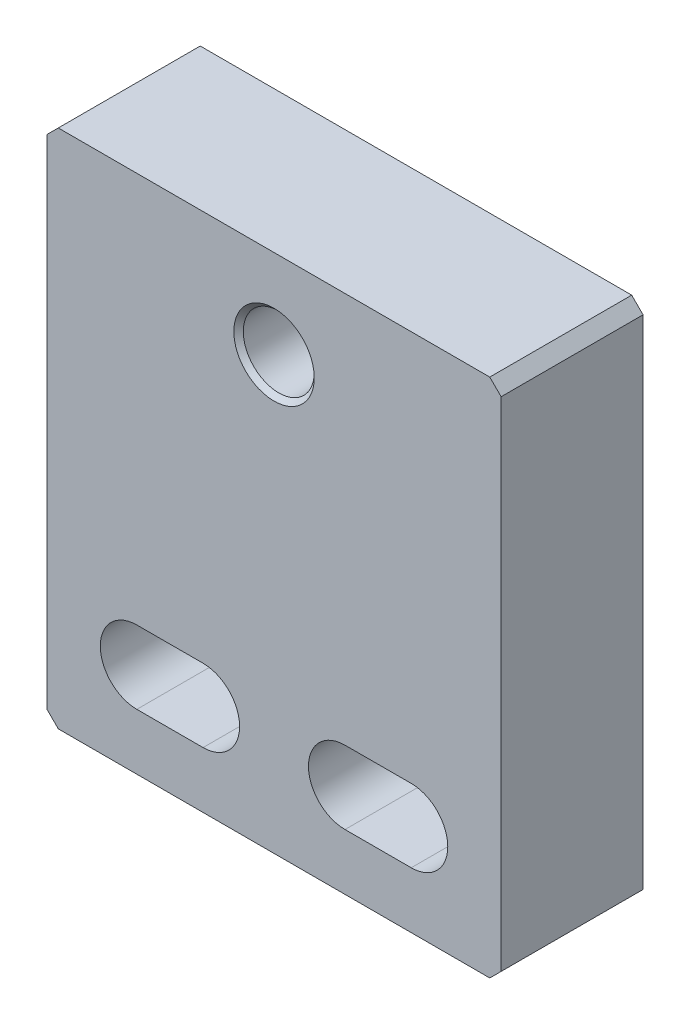
ISO-10303-21;
HEADER;
FILE_DESCRIPTION(('STEP AP214'),'2;1');
FILE_NAME('part.step','',(''),(''),'','','');
FILE_SCHEMA(('AUTOMOTIVE_DESIGN { 1 0 10303 214 1 1 1 1 }'));
ENDSEC;
DATA;
#1=APPLICATION_CONTEXT('core data for automotive mechanical design processes');
#2=APPLICATION_PROTOCOL_DEFINITION('international standard','automotive_design',2000,#1);
#3=PRODUCT_CONTEXT('',#1,'mechanical');
#4=PRODUCT('Part','Part','',(#3));
#5=PRODUCT_RELATED_PRODUCT_CATEGORY('part','',(#4));
#6=PRODUCT_DEFINITION_FORMATION('','',#4);
#7=PRODUCT_DEFINITION_CONTEXT('part definition',#1,'design');
#8=PRODUCT_DEFINITION('design','',#6,#7);
#9=PRODUCT_DEFINITION_SHAPE('','',#8);
#10=(LENGTH_UNIT() NAMED_UNIT(*) SI_UNIT(.MILLI.,.METRE.));
#11=(NAMED_UNIT(*) PLANE_ANGLE_UNIT() SI_UNIT($,.RADIAN.));
#12=(NAMED_UNIT(*) SI_UNIT($,.STERADIAN.) SOLID_ANGLE_UNIT());
#13=UNCERTAINTY_MEASURE_WITH_UNIT(LENGTH_MEASURE(1.E-05),#10,'distance_accuracy_value','');
#14=(GEOMETRIC_REPRESENTATION_CONTEXT(3) GLOBAL_UNCERTAINTY_ASSIGNED_CONTEXT((#13)) GLOBAL_UNIT_ASSIGNED_CONTEXT((#10,
#11,#12)) REPRESENTATION_CONTEXT('',''));
#15=CARTESIAN_POINT('',(0.,0.,0.));
#16=DIRECTION('',(0.,0.,1.));
#17=DIRECTION('',(1.,0.,0.));
#18=AXIS2_PLACEMENT_3D('',#15,#16,#17);
#19=CARTESIAN_POINT('',(-30.4799999999999,55.88,-19.05));
#20=DIRECTION('',(-0.707106781186456,0.707106781186639,0.));
#21=DIRECTION('',(-0.707106781186639,-0.707106781186456,0.));
#22=AXIS2_PLACEMENT_3D('',#19,#20,#21);
#23=PLANE('',#22);
#24=DIRECTION('',(-0.707106781186639,-0.707106781186456,0.));
#25=VECTOR('',#24,1.);
#26=CARTESIAN_POINT('',(-30.4799999999999,55.88,0.));
#27=LINE('',#26,#25);
#28=CARTESIAN_POINT('',(-28.9559999999999,57.4039999999996,0.));
#29=VERTEX_POINT('',#28);
#30=CARTESIAN_POINT('',(-30.4799999999999,55.88,0.));
#31=VERTEX_POINT('',#30);
#32=EDGE_CURVE('E217',#29,#31,#27,.T.);
#33=ORIENTED_EDGE('',*,*,#32,.F.);
#34=DIRECTION('',(0.,0.,1.));
#35=VECTOR('',#34,1.);
#36=CARTESIAN_POINT('',(-28.9559999999999,57.4039999999996,-19.05));
#37=LINE('',#36,#35);
#38=CARTESIAN_POINT('',(-28.9559999999999,57.4039999999996,-19.05));
#39=VERTEX_POINT('',#38);
#40=EDGE_CURVE('E11',#39,#29,#37,.T.);
#41=ORIENTED_EDGE('',*,*,#40,.F.);
#42=DIRECTION('',(-0.707106781186639,-0.707106781186456,0.));
#43=VECTOR('',#42,1.);
#44=CARTESIAN_POINT('',(-30.4799999999999,55.88,-19.05));
#45=LINE('',#44,#43);
#46=CARTESIAN_POINT('',(-30.4799999999999,55.88,-19.05));
#47=VERTEX_POINT('',#46);
#48=EDGE_CURVE('E224',#39,#47,#45,.T.);
#49=ORIENTED_EDGE('',*,*,#48,.T.);
#50=DIRECTION('',(0.,0.,1.));
#51=VECTOR('',#50,1.);
#52=CARTESIAN_POINT('',(-30.4799999999999,55.88,-19.05));
#53=LINE('',#52,#51);
#54=EDGE_CURVE('E42',#47,#31,#53,.T.);
#55=ORIENTED_EDGE('',*,*,#54,.T.);
#56=EDGE_LOOP('',(#33,#41,#49,#55));
#57=FACE_BOUND('',#56,.T.);
#58=ADVANCED_FACE('F39',(#57),#23,.T.);
#59=CARTESIAN_POINT('',(-28.9559999999999,57.4039999999996,-19.05));
#60=DIRECTION('',(0.,1.,0.));
#61=DIRECTION('',(-1.,0.,0.));
#62=AXIS2_PLACEMENT_3D('',#59,#60,#61);
#63=PLANE('',#62);
#64=DIRECTION('',(-1.,0.,0.));
#65=VECTOR('',#64,1.);
#66=CARTESIAN_POINT('',(-28.9559999999999,57.4039999999996,0.));
#67=LINE('',#66,#65);
#68=CARTESIAN_POINT('',(28.9559999999999,57.4039999999996,0.));
#69=VERTEX_POINT('',#68);
#70=EDGE_CURVE('E228',#69,#29,#67,.T.);
#71=ORIENTED_EDGE('',*,*,#70,.F.);
#72=DIRECTION('',(0.,0.,1.));
#73=VECTOR('',#72,1.);
#74=CARTESIAN_POINT('',(28.9559999999999,57.4039999999996,-19.05));
#75=LINE('',#74,#73);
#76=CARTESIAN_POINT('',(28.9559999999999,57.4039999999996,-19.05));
#77=VERTEX_POINT('',#76);
#78=EDGE_CURVE('E47',#77,#69,#75,.T.);
#79=ORIENTED_EDGE('',*,*,#78,.F.);
#80=DIRECTION('',(-1.,0.,0.));
#81=VECTOR('',#80,1.);
#82=CARTESIAN_POINT('',(-28.9559999999999,57.4039999999996,-19.05));
#83=LINE('',#82,#81);
#84=EDGE_CURVE('E246',#77,#39,#83,.T.);
#85=ORIENTED_EDGE('',*,*,#84,.T.);
#86=ORIENTED_EDGE('',*,*,#40,.T.);
#87=EDGE_LOOP('',(#71,#79,#85,#86));
#88=FACE_BOUND('',#87,.T.);
#89=ADVANCED_FACE('F293',(#88),#63,.T.);
#90=CARTESIAN_POINT('',(28.9559999999999,57.4039999999996,-19.05));
#91=DIRECTION('',(0.707106781186549,0.707106781186546,0.));
#92=DIRECTION('',(-0.707106781186546,0.707106781186549,0.));
#93=AXIS2_PLACEMENT_3D('',#90,#91,#92);
#94=PLANE('',#93);
#95=DIRECTION('',(-0.707106781186546,0.707106781186549,0.));
#96=VECTOR('',#95,1.);
#97=CARTESIAN_POINT('',(28.9559999999999,57.4039999999996,0.));
#98=LINE('',#97,#96);
#99=CARTESIAN_POINT('',(30.4799999999999,55.8799999999996,0.));
#100=VERTEX_POINT('',#99);
#101=EDGE_CURVE('E266',#100,#69,#98,.T.);
#102=ORIENTED_EDGE('',*,*,#101,.F.);
#103=DIRECTION('',(0.,0.,1.));
#104=VECTOR('',#103,1.);
#105=CARTESIAN_POINT('',(30.4799999999999,55.8799999999996,-19.05));
#106=LINE('',#105,#104);
#107=CARTESIAN_POINT('',(30.4799999999999,55.8799999999996,-19.05));
#108=VERTEX_POINT('',#107);
#109=EDGE_CURVE('E272',#108,#100,#106,.T.);
#110=ORIENTED_EDGE('',*,*,#109,.F.);
#111=DIRECTION('',(-0.707106781186546,0.707106781186549,0.));
#112=VECTOR('',#111,1.);
#113=CARTESIAN_POINT('',(28.9559999999999,57.4039999999996,-19.05));
#114=LINE('',#113,#112);
#115=EDGE_CURVE('E243',#108,#77,#114,.T.);
#116=ORIENTED_EDGE('',*,*,#115,.T.);
#117=ORIENTED_EDGE('',*,*,#78,.T.);
#118=EDGE_LOOP('',(#102,#110,#116,#117));
#119=FACE_BOUND('',#118,.T.);
#120=ADVANCED_FACE('F313',(#119),#94,.T.);
#121=CARTESIAN_POINT('',(30.4799999999999,55.8799999999996,-19.05));
#122=DIRECTION('',(1.,0.,0.));
#123=DIRECTION('',(0.,1.,0.));
#124=AXIS2_PLACEMENT_3D('',#121,#122,#123);
#125=PLANE('',#124);
#126=DIRECTION('',(0.,1.,0.));
#127=VECTOR('',#126,1.);
#128=CARTESIAN_POINT('',(30.4799999999999,55.8799999999996,0.));
#129=LINE('',#128,#127);
#130=CARTESIAN_POINT('',(30.48,-10.922,0.));
#131=VERTEX_POINT('',#130);
#132=EDGE_CURVE('E263',#131,#100,#129,.T.);
#133=ORIENTED_EDGE('',*,*,#132,.F.);
#134=DIRECTION('',(0.,0.,1.));
#135=VECTOR('',#134,1.);
#136=CARTESIAN_POINT('',(30.48,-10.922,-19.05));
#137=LINE('',#136,#135);
#138=CARTESIAN_POINT('',(30.48,-10.922,-19.05));
#139=VERTEX_POINT('',#138);
#140=EDGE_CURVE('E274',#139,#131,#137,.T.);
#141=ORIENTED_EDGE('',*,*,#140,.F.);
#142=DIRECTION('',(0.,1.,0.));
#143=VECTOR('',#142,1.);
#144=CARTESIAN_POINT('',(30.4799999999999,55.8799999999996,-19.05));
#145=LINE('',#144,#143);
#146=EDGE_CURVE('E240',#139,#108,#145,.T.);
#147=ORIENTED_EDGE('',*,*,#146,.T.);
#148=ORIENTED_EDGE('',*,*,#109,.T.);
#149=EDGE_LOOP('',(#133,#141,#147,#148));
#150=FACE_BOUND('',#149,.T.);
#151=ADVANCED_FACE('F311',(#150),#125,.T.);
#152=CARTESIAN_POINT('',(28.956,-12.446,-19.05));
#153=DIRECTION('',(0.707106781186548,-0.707106781186547,0.));
#154=DIRECTION('',(0.707106781186547,0.707106781186548,0.));
#155=AXIS2_PLACEMENT_3D('',#152,#153,#154);
#156=PLANE('',#155);
#157=DIRECTION('',(0.707106781186547,0.707106781186548,0.));
#158=VECTOR('',#157,1.);
#159=CARTESIAN_POINT('',(28.956,-12.446,0.));
#160=LINE('',#159,#158);
#161=CARTESIAN_POINT('',(28.956,-12.446,0.));
#162=VERTEX_POINT('',#161);
#163=EDGE_CURVE('E260',#162,#131,#160,.T.);
#164=ORIENTED_EDGE('',*,*,#163,.F.);
#165=DIRECTION('',(0.,0.,1.));
#166=VECTOR('',#165,1.);
#167=CARTESIAN_POINT('',(28.956,-12.446,-19.05));
#168=LINE('',#167,#166);
#169=CARTESIAN_POINT('',(28.956,-12.446,-19.05));
#170=VERTEX_POINT('',#169);
#171=EDGE_CURVE('E276',#170,#162,#168,.T.);
#172=ORIENTED_EDGE('',*,*,#171,.F.);
#173=DIRECTION('',(0.707106781186547,0.707106781186548,0.));
#174=VECTOR('',#173,1.);
#175=CARTESIAN_POINT('',(28.956,-12.446,-19.05));
#176=LINE('',#175,#174);
#177=EDGE_CURVE('E237',#170,#139,#176,.T.);
#178=ORIENTED_EDGE('',*,*,#177,.T.);
#179=ORIENTED_EDGE('',*,*,#140,.T.);
#180=EDGE_LOOP('',(#164,#172,#178,#179));
#181=FACE_BOUND('',#180,.T.);
#182=ADVANCED_FACE('F307',(#181),#156,.T.);
#183=CARTESIAN_POINT('',(-28.956,-12.446,-19.05));
#184=DIRECTION('',(0.,-1.,0.));
#185=DIRECTION('',(0.,0.,-1.));
#186=AXIS2_PLACEMENT_3D('',#183,#184,#185);
#187=PLANE('',#186);
#188=DIRECTION('',(1.,0.,0.));
#189=VECTOR('',#188,1.);
#190=CARTESIAN_POINT('',(-28.956,-12.446,0.));
#191=LINE('',#190,#189);
#192=CARTESIAN_POINT('',(-28.956,-12.446,0.));
#193=VERTEX_POINT('',#192);
#194=EDGE_CURVE('E257',#193,#162,#191,.T.);
#195=ORIENTED_EDGE('',*,*,#194,.F.);
#196=DIRECTION('',(0.,0.,1.));
#197=VECTOR('',#196,1.);
#198=CARTESIAN_POINT('',(-28.956,-12.446,-19.05));
#199=LINE('',#198,#197);
#200=CARTESIAN_POINT('',(-28.956,-12.446,-19.05));
#201=VERTEX_POINT('',#200);
#202=EDGE_CURVE('E278',#201,#193,#199,.T.);
#203=ORIENTED_EDGE('',*,*,#202,.F.);
#204=DIRECTION('',(1.,0.,0.));
#205=VECTOR('',#204,1.);
#206=CARTESIAN_POINT('',(-28.956,-12.446,-19.05));
#207=LINE('',#206,#205);
#208=EDGE_CURVE('E234',#201,#170,#207,.T.);
#209=ORIENTED_EDGE('',*,*,#208,.T.);
#210=ORIENTED_EDGE('',*,*,#171,.T.);
#211=EDGE_LOOP('',(#195,#203,#209,#210));
#212=FACE_BOUND('',#211,.T.);
#213=ADVANCED_FACE('F305',(#212),#187,.T.);
#214=CARTESIAN_POINT('',(-30.48,-10.9220000000001,-19.05));
#215=DIRECTION('',(-0.707106781186534,-0.707106781186561,0.));
#216=DIRECTION('',(0.707106781186561,-0.707106781186534,0.));
#217=AXIS2_PLACEMENT_3D('',#214,#215,#216);
#218=PLANE('',#217);
#219=DIRECTION('',(0.707106781186561,-0.707106781186534,0.));
#220=VECTOR('',#219,1.);
#221=CARTESIAN_POINT('',(-30.48,-10.9220000000001,0.));
#222=LINE('',#221,#220);
#223=CARTESIAN_POINT('',(-30.48,-10.9220000000001,0.));
#224=VERTEX_POINT('',#223);
#225=EDGE_CURVE('E254',#224,#193,#222,.T.);
#226=ORIENTED_EDGE('',*,*,#225,.F.);
#227=DIRECTION('',(0.,0.,1.));
#228=VECTOR('',#227,1.);
#229=CARTESIAN_POINT('',(-30.48,-10.9220000000001,-19.05));
#230=LINE('',#229,#228);
#231=CARTESIAN_POINT('',(-30.48,-10.9220000000001,-19.05));
#232=VERTEX_POINT('',#231);
#233=EDGE_CURVE('E279',#232,#224,#230,.T.);
#234=ORIENTED_EDGE('',*,*,#233,.F.);
#235=DIRECTION('',(0.707106781186561,-0.707106781186534,0.));
#236=VECTOR('',#235,1.);
#237=CARTESIAN_POINT('',(-30.48,-10.9220000000001,-19.05));
#238=LINE('',#237,#236);
#239=EDGE_CURVE('E231',#232,#201,#238,.T.);
#240=ORIENTED_EDGE('',*,*,#239,.T.);
#241=ORIENTED_EDGE('',*,*,#202,.T.);
#242=EDGE_LOOP('',(#226,#234,#240,#241));
#243=FACE_BOUND('',#242,.T.);
#244=ADVANCED_FACE('F301',(#243),#218,.T.);
#245=CARTESIAN_POINT('',(-30.4799999999999,55.88,-19.05));
#246=DIRECTION('',(-1.,0.,0.));
#247=DIRECTION('',(0.,-1.,0.));
#248=AXIS2_PLACEMENT_3D('',#245,#246,#247);
#249=PLANE('',#248);
#250=DIRECTION('',(0.,-1.,0.));
#251=VECTOR('',#250,1.);
#252=CARTESIAN_POINT('',(-30.4799999999999,55.88,0.));
#253=LINE('',#252,#251);
#254=EDGE_CURVE('E251',#31,#224,#253,.T.);
#255=ORIENTED_EDGE('',*,*,#254,.F.);
#256=ORIENTED_EDGE('',*,*,#54,.F.);
#257=DIRECTION('',(0.,-1.,0.));
#258=VECTOR('',#257,1.);
#259=CARTESIAN_POINT('',(-30.4799999999999,55.88,-19.05));
#260=LINE('',#259,#258);
#261=EDGE_CURVE('E227',#47,#232,#260,.T.);
#262=ORIENTED_EDGE('',*,*,#261,.T.);
#263=ORIENTED_EDGE('',*,*,#233,.T.);
#264=EDGE_LOOP('',(#255,#256,#262,#263));
#265=FACE_BOUND('',#264,.T.);
#266=ADVANCED_FACE('F287',(#265),#249,.T.);
#267=CARTESIAN_POINT('',(0.,0.,-19.05));
#268=DIRECTION('',(0.,0.,-1.));
#269=DIRECTION('',(-1.,0.,0.));
#270=AXIS2_PLACEMENT_3D('',#267,#268,#269);
#271=PLANE('',#270);
#272=CARTESIAN_POINT('',(0.,45.5295,-19.05));
#273=DIRECTION('',(0.,0.,1.));
#274=DIRECTION('',(1.,0.,0.));
#275=AXIS2_PLACEMENT_3D('',#272,#273,#274);
#276=CIRCLE('',#275,4.7625);
#277=CARTESIAN_POINT('',(4.7625,45.5295,-19.05));
#278=VERTEX_POINT('',#277);
#279=EDGE_CURVE('E176',#278,#278,#276,.T.);
#280=ORIENTED_EDGE('',*,*,#279,.T.);
#281=EDGE_LOOP('',(#280));
#282=FACE_BOUND('',#281,.T.);
#283=CARTESIAN_POINT('',(-9.525,0.,-19.05));
#284=DIRECTION('',(0.,0.,1.));
#285=DIRECTION('',(-1.,0.,0.));
#286=AXIS2_PLACEMENT_3D('',#283,#284,#285);
#287=CIRCLE('',#286,4.90220000000001);
#288=CARTESIAN_POINT('',(-9.525,-4.90220000000001,-19.05));
#289=VERTEX_POINT('',#288);
#290=CARTESIAN_POINT('',(-9.525,4.90220000000001,-19.05));
#291=VERTEX_POINT('',#290);
#292=EDGE_CURVE('E154',#289,#291,#287,.T.);
#293=ORIENTED_EDGE('',*,*,#292,.T.);
#294=DIRECTION('',(-1.,0.,0.));
#295=VECTOR('',#294,1.);
#296=CARTESIAN_POINT('',(-9.525,4.90220000000001,-19.05));
#297=LINE('',#296,#295);
#298=CARTESIAN_POINT('',(-18.415,4.90220000000001,-19.05));
#299=VERTEX_POINT('',#298);
#300=EDGE_CURVE('E163',#291,#299,#297,.T.);
#301=ORIENTED_EDGE('',*,*,#300,.T.);
#302=CARTESIAN_POINT('',(-18.415,0.,-19.05));
#303=DIRECTION('',(0.,0.,1.));
#304=DIRECTION('',(-1.,0.,0.));
#305=AXIS2_PLACEMENT_3D('',#302,#303,#304);
#306=CIRCLE('',#305,4.90220000000001);
#307=CARTESIAN_POINT('',(-18.415,-4.90220000000001,-19.05));
#308=VERTEX_POINT('',#307);
#309=EDGE_CURVE('E55',#299,#308,#306,.T.);
#310=ORIENTED_EDGE('',*,*,#309,.T.);
#311=DIRECTION('',(1.,0.,0.));
#312=VECTOR('',#311,1.);
#313=CARTESIAN_POINT('',(-9.525,-4.90220000000001,-19.05));
#314=LINE('',#313,#312);
#315=EDGE_CURVE('E160',#308,#289,#314,.T.);
#316=ORIENTED_EDGE('',*,*,#315,.T.);
#317=EDGE_LOOP('',(#293,#301,#310,#316));
#318=FACE_BOUND('',#317,.T.);
#319=CARTESIAN_POINT('',(9.525,0.,-19.05));
#320=DIRECTION('',(0.,0.,1.));
#321=DIRECTION('',(1.,0.,0.));
#322=AXIS2_PLACEMENT_3D('',#319,#320,#321);
#323=CIRCLE('',#322,4.90220000000001);
#324=CARTESIAN_POINT('',(9.525,4.90220000000001,-19.05));
#325=VERTEX_POINT('',#324);
#326=CARTESIAN_POINT('',(9.52500000000001,-4.90220000000001,-19.05));
#327=VERTEX_POINT('',#326);
#328=EDGE_CURVE('E192',#325,#327,#323,.T.);
#329=ORIENTED_EDGE('',*,*,#328,.T.);
#330=DIRECTION('',(1.,0.,0.));
#331=VECTOR('',#330,1.);
#332=CARTESIAN_POINT('',(9.52500000000001,-4.90220000000001,-19.05));
#333=LINE('',#332,#331);
#334=CARTESIAN_POINT('',(18.415,-4.90220000000001,-19.05));
#335=VERTEX_POINT('',#334);
#336=EDGE_CURVE('E195',#327,#335,#333,.T.);
#337=ORIENTED_EDGE('',*,*,#336,.T.);
#338=CARTESIAN_POINT('',(18.415,0.,-19.05));
#339=DIRECTION('',(0.,0.,1.));
#340=DIRECTION('',(1.,0.,0.));
#341=AXIS2_PLACEMENT_3D('',#338,#339,#340);
#342=CIRCLE('',#341,4.90220000000001);
#343=CARTESIAN_POINT('',(18.415,4.90220000000001,-19.05));
#344=VERTEX_POINT('',#343);
#345=EDGE_CURVE('E199',#335,#344,#342,.T.);
#346=ORIENTED_EDGE('',*,*,#345,.T.);
#347=DIRECTION('',(-1.,0.,0.));
#348=VECTOR('',#347,1.);
#349=CARTESIAN_POINT('',(9.525,4.90220000000001,-19.05));
#350=LINE('',#349,#348);
#351=EDGE_CURVE('E202',#344,#325,#350,.T.);
#352=ORIENTED_EDGE('',*,*,#351,.T.);
#353=EDGE_LOOP('',(#329,#337,#346,#352));
#354=FACE_BOUND('',#353,.T.);
#355=ORIENTED_EDGE('',*,*,#48,.F.);
#356=ORIENTED_EDGE('',*,*,#84,.F.);
#357=ORIENTED_EDGE('',*,*,#115,.F.);
#358=ORIENTED_EDGE('',*,*,#146,.F.);
#359=ORIENTED_EDGE('',*,*,#177,.F.);
#360=ORIENTED_EDGE('',*,*,#208,.F.);
#361=ORIENTED_EDGE('',*,*,#239,.F.);
#362=ORIENTED_EDGE('',*,*,#261,.F.);
#363=EDGE_LOOP('',(#355,#356,#357,#358,#359,#360,#361,#362));
#364=FACE_BOUND('',#363,.T.);
#365=ADVANCED_FACE('F167',(#282,#318,#354,#364),#271,.T.);
#366=CARTESIAN_POINT('',(0.,0.,0.));
#367=DIRECTION('',(0.,0.,-1.));
#368=DIRECTION('',(-1.,0.,0.));
#369=AXIS2_PLACEMENT_3D('',#366,#367,#368);
#370=PLANE('',#369);
#371=CARTESIAN_POINT('',(0.,45.5295,0.));
#372=DIRECTION('',(0.,0.,1.));
#373=DIRECTION('',(1.,0.,0.));
#374=AXIS2_PLACEMENT_3D('',#371,#372,#373);
#375=CIRCLE('',#374,5.3975);
#376=CARTESIAN_POINT('',(5.3975,45.5295,0.));
#377=VERTEX_POINT('',#376);
#378=EDGE_CURVE('E495',#377,#377,#375,.T.);
#379=ORIENTED_EDGE('',*,*,#378,.F.);
#380=EDGE_LOOP('',(#379));
#381=FACE_BOUND('',#380,.T.);
#382=DIRECTION('',(-1.,0.,0.));
#383=VECTOR('',#382,1.);
#384=CARTESIAN_POINT('',(-9.525,4.90220000000001,0.));
#385=LINE('',#384,#383);
#386=CARTESIAN_POINT('',(-9.525,4.90220000000001,0.));
#387=VERTEX_POINT('',#386);
#388=CARTESIAN_POINT('',(-18.415,4.90220000000001,0.));
#389=VERTEX_POINT('',#388);
#390=EDGE_CURVE('E182',#387,#389,#385,.T.);
#391=ORIENTED_EDGE('',*,*,#390,.F.);
#392=CARTESIAN_POINT('',(-9.525,0.,0.));
#393=DIRECTION('',(0.,0.,1.));
#394=DIRECTION('',(-1.,0.,0.));
#395=AXIS2_PLACEMENT_3D('',#392,#393,#394);
#396=CIRCLE('',#395,4.90220000000001);
#397=CARTESIAN_POINT('',(-9.525,-4.90220000000001,0.));
#398=VERTEX_POINT('',#397);
#399=EDGE_CURVE('E63',#398,#387,#396,.T.);
#400=ORIENTED_EDGE('',*,*,#399,.F.);
#401=DIRECTION('',(1.,0.,0.));
#402=VECTOR('',#401,1.);
#403=CARTESIAN_POINT('',(-9.525,-4.90220000000001,0.));
#404=LINE('',#403,#402);
#405=CARTESIAN_POINT('',(-18.415,-4.90220000000001,0.));
#406=VERTEX_POINT('',#405);
#407=EDGE_CURVE('E170',#406,#398,#404,.T.);
#408=ORIENTED_EDGE('',*,*,#407,.F.);
#409=CARTESIAN_POINT('',(-18.415,0.,0.));
#410=DIRECTION('',(0.,0.,1.));
#411=DIRECTION('',(-1.,0.,0.));
#412=AXIS2_PLACEMENT_3D('',#409,#410,#411);
#413=CIRCLE('',#412,4.90220000000001);
#414=EDGE_CURVE('E173',#389,#406,#413,.T.);
#415=ORIENTED_EDGE('',*,*,#414,.F.);
#416=EDGE_LOOP('',(#391,#400,#408,#415));
#417=FACE_BOUND('',#416,.T.);
#418=DIRECTION('',(1.,0.,0.));
#419=VECTOR('',#418,1.);
#420=CARTESIAN_POINT('',(9.52500000000001,-4.90220000000001,0.));
#421=LINE('',#420,#419);
#422=CARTESIAN_POINT('',(9.52500000000001,-4.90220000000001,0.));
#423=VERTEX_POINT('',#422);
#424=CARTESIAN_POINT('',(18.415,-4.90220000000001,0.));
#425=VERTEX_POINT('',#424);
#426=EDGE_CURVE('E207',#423,#425,#421,.T.);
#427=ORIENTED_EDGE('',*,*,#426,.F.);
#428=CARTESIAN_POINT('',(9.525,0.,0.));
#429=DIRECTION('',(0.,0.,1.));
#430=DIRECTION('',(1.,0.,0.));
#431=AXIS2_PLACEMENT_3D('',#428,#429,#430);
#432=CIRCLE('',#431,4.90220000000001);
#433=CARTESIAN_POINT('',(9.525,4.90220000000001,0.));
#434=VERTEX_POINT('',#433);
#435=EDGE_CURVE('E188',#434,#423,#432,.T.);
#436=ORIENTED_EDGE('',*,*,#435,.F.);
#437=DIRECTION('',(-1.,0.,0.));
#438=VECTOR('',#437,1.);
#439=CARTESIAN_POINT('',(9.525,4.90220000000001,0.));
#440=LINE('',#439,#438);
#441=CARTESIAN_POINT('',(18.415,4.90220000000001,0.));
#442=VERTEX_POINT('',#441);
#443=EDGE_CURVE('E196',#442,#434,#440,.T.);
#444=ORIENTED_EDGE('',*,*,#443,.F.);
#445=CARTESIAN_POINT('',(18.415,0.,0.));
#446=DIRECTION('',(0.,0.,1.));
#447=DIRECTION('',(1.,0.,0.));
#448=AXIS2_PLACEMENT_3D('',#445,#446,#447);
#449=CIRCLE('',#448,4.90220000000001);
#450=EDGE_CURVE('E210',#425,#442,#449,.T.);
#451=ORIENTED_EDGE('',*,*,#450,.F.);
#452=EDGE_LOOP('',(#427,#436,#444,#451));
#453=FACE_BOUND('',#452,.T.);
#454=ORIENTED_EDGE('',*,*,#32,.T.);
#455=ORIENTED_EDGE('',*,*,#254,.T.);
#456=ORIENTED_EDGE('',*,*,#225,.T.);
#457=ORIENTED_EDGE('',*,*,#194,.T.);
#458=ORIENTED_EDGE('',*,*,#163,.T.);
#459=ORIENTED_EDGE('',*,*,#132,.T.);
#460=ORIENTED_EDGE('',*,*,#101,.T.);
#461=ORIENTED_EDGE('',*,*,#70,.T.);
#462=EDGE_LOOP('',(#454,#455,#456,#457,#458,#459,#460,#461));
#463=FACE_BOUND('',#462,.T.);
#464=ADVANCED_FACE('F289',(#381,#417,#453,#463),#370,.F.);
#465=CARTESIAN_POINT('',(9.525,0.,-19.05));
#466=DIRECTION('',(0.,0.,1.));
#467=DIRECTION('',(1.,0.,0.));
#468=AXIS2_PLACEMENT_3D('',#465,#466,#467);
#469=CYLINDRICAL_SURFACE('',#468,4.90220000000001);
#470=ORIENTED_EDGE('',*,*,#435,.T.);
#471=DIRECTION('',(0.,0.,1.));
#472=VECTOR('',#471,1.);
#473=CARTESIAN_POINT('',(9.52500000000001,-4.90220000000001,-19.05));
#474=LINE('',#473,#472);
#475=EDGE_CURVE('E205',#327,#423,#474,.T.);
#476=ORIENTED_EDGE('',*,*,#475,.F.);
#477=ORIENTED_EDGE('',*,*,#328,.F.);
#478=DIRECTION('',(0.,0.,1.));
#479=VECTOR('',#478,1.);
#480=CARTESIAN_POINT('',(9.525,4.90220000000001,-19.05));
#481=LINE('',#480,#479);
#482=EDGE_CURVE('E215',#325,#434,#481,.T.);
#483=ORIENTED_EDGE('',*,*,#482,.T.);
#484=EDGE_LOOP('',(#470,#476,#477,#483));
#485=FACE_BOUND('',#484,.T.);
#486=ADVANCED_FACE('F377',(#485),#469,.F.);
#487=CARTESIAN_POINT('',(9.525,4.90220000000001,-19.05));
#488=DIRECTION('',(0.,1.,0.));
#489=DIRECTION('',(0.,0.,1.));
#490=AXIS2_PLACEMENT_3D('',#487,#488,#489);
#491=PLANE('',#490);
#492=ORIENTED_EDGE('',*,*,#443,.T.);
#493=ORIENTED_EDGE('',*,*,#482,.F.);
#494=ORIENTED_EDGE('',*,*,#351,.F.);
#495=DIRECTION('',(0.,0.,1.));
#496=VECTOR('',#495,1.);
#497=CARTESIAN_POINT('',(18.415,4.90220000000001,-19.05));
#498=LINE('',#497,#496);
#499=EDGE_CURVE('E218',#344,#442,#498,.T.);
#500=ORIENTED_EDGE('',*,*,#499,.T.);
#501=EDGE_LOOP('',(#492,#493,#494,#500));
#502=FACE_BOUND('',#501,.T.);
#503=ADVANCED_FACE('F382',(#502),#491,.F.);
#504=CARTESIAN_POINT('',(18.415,0.,-19.05));
#505=DIRECTION('',(0.,0.,1.));
#506=DIRECTION('',(1.,0.,0.));
#507=AXIS2_PLACEMENT_3D('',#504,#505,#506);
#508=CYLINDRICAL_SURFACE('',#507,4.90220000000001);
#509=ORIENTED_EDGE('',*,*,#450,.T.);
#510=ORIENTED_EDGE('',*,*,#499,.F.);
#511=ORIENTED_EDGE('',*,*,#345,.F.);
#512=DIRECTION('',(0.,0.,1.));
#513=VECTOR('',#512,1.);
#514=CARTESIAN_POINT('',(18.415,-4.90220000000001,-19.05));
#515=LINE('',#514,#513);
#516=EDGE_CURVE('E220',#335,#425,#515,.T.);
#517=ORIENTED_EDGE('',*,*,#516,.T.);
#518=EDGE_LOOP('',(#509,#510,#511,#517));
#519=FACE_BOUND('',#518,.T.);
#520=ADVANCED_FACE('F394',(#519),#508,.F.);
#521=CARTESIAN_POINT('',(9.52500000000001,-4.90220000000001,-19.05));
#522=DIRECTION('',(0.,-1.,0.));
#523=DIRECTION('',(1.,0.,0.));
#524=AXIS2_PLACEMENT_3D('',#521,#522,#523);
#525=PLANE('',#524);
#526=ORIENTED_EDGE('',*,*,#426,.T.);
#527=ORIENTED_EDGE('',*,*,#516,.F.);
#528=ORIENTED_EDGE('',*,*,#336,.F.);
#529=ORIENTED_EDGE('',*,*,#475,.T.);
#530=EDGE_LOOP('',(#526,#527,#528,#529));
#531=FACE_BOUND('',#530,.T.);
#532=ADVANCED_FACE('F404',(#531),#525,.F.);
#533=CARTESIAN_POINT('',(-9.525,0.,-19.05));
#534=DIRECTION('',(0.,0.,1.));
#535=DIRECTION('',(1.,0.,0.));
#536=AXIS2_PLACEMENT_3D('',#533,#534,#535);
#537=CYLINDRICAL_SURFACE('',#536,4.90220000000001);
#538=ORIENTED_EDGE('',*,*,#399,.T.);
#539=DIRECTION('',(0.,0.,1.));
#540=VECTOR('',#539,1.);
#541=CARTESIAN_POINT('',(-9.525,4.90220000000001,-19.05));
#542=LINE('',#541,#540);
#543=EDGE_CURVE('E150',#291,#387,#542,.T.);
#544=ORIENTED_EDGE('',*,*,#543,.F.);
#545=ORIENTED_EDGE('',*,*,#292,.F.);
#546=DIRECTION('',(0.,0.,1.));
#547=VECTOR('',#546,1.);
#548=CARTESIAN_POINT('',(-9.525,-4.90220000000001,-19.05));
#549=LINE('',#548,#547);
#550=EDGE_CURVE('E186',#289,#398,#549,.T.);
#551=ORIENTED_EDGE('',*,*,#550,.T.);
#552=EDGE_LOOP('',(#538,#544,#545,#551));
#553=FACE_BOUND('',#552,.T.);
#554=ADVANCED_FACE('F152',(#553),#537,.F.);
#555=CARTESIAN_POINT('',(-9.525,-4.90220000000001,-19.05));
#556=DIRECTION('',(0.,-1.,0.));
#557=DIRECTION('',(0.,0.,-1.));
#558=AXIS2_PLACEMENT_3D('',#555,#556,#557);
#559=PLANE('',#558);
#560=ORIENTED_EDGE('',*,*,#407,.T.);
#561=ORIENTED_EDGE('',*,*,#550,.F.);
#562=ORIENTED_EDGE('',*,*,#315,.F.);
#563=DIRECTION('',(0.,0.,1.));
#564=VECTOR('',#563,1.);
#565=CARTESIAN_POINT('',(-18.415,-4.90220000000001,-19.05));
#566=LINE('',#565,#564);
#567=EDGE_CURVE('E189',#308,#406,#566,.T.);
#568=ORIENTED_EDGE('',*,*,#567,.T.);
#569=EDGE_LOOP('',(#560,#561,#562,#568));
#570=FACE_BOUND('',#569,.T.);
#571=ADVANCED_FACE('F423',(#570),#559,.F.);
#572=CARTESIAN_POINT('',(-18.415,0.,-19.05));
#573=DIRECTION('',(0.,0.,1.));
#574=DIRECTION('',(1.,0.,0.));
#575=AXIS2_PLACEMENT_3D('',#572,#573,#574);
#576=CYLINDRICAL_SURFACE('',#575,4.90220000000001);
#577=ORIENTED_EDGE('',*,*,#414,.T.);
#578=ORIENTED_EDGE('',*,*,#567,.F.);
#579=ORIENTED_EDGE('',*,*,#309,.F.);
#580=DIRECTION('',(0.,0.,1.));
#581=VECTOR('',#580,1.);
#582=CARTESIAN_POINT('',(-18.415,4.90220000000001,-19.05));
#583=LINE('',#582,#581);
#584=EDGE_CURVE('E159',#299,#389,#583,.T.);
#585=ORIENTED_EDGE('',*,*,#584,.T.);
#586=EDGE_LOOP('',(#577,#578,#579,#585));
#587=FACE_BOUND('',#586,.T.);
#588=ADVANCED_FACE('F432',(#587),#576,.F.);
#589=CARTESIAN_POINT('',(-9.525,4.90220000000001,-19.05));
#590=DIRECTION('',(0.,1.,0.));
#591=DIRECTION('',(0.,0.,1.));
#592=AXIS2_PLACEMENT_3D('',#589,#590,#591);
#593=PLANE('',#592);
#594=ORIENTED_EDGE('',*,*,#390,.T.);
#595=ORIENTED_EDGE('',*,*,#584,.F.);
#596=ORIENTED_EDGE('',*,*,#300,.F.);
#597=ORIENTED_EDGE('',*,*,#543,.T.);
#598=EDGE_LOOP('',(#594,#595,#596,#597));
#599=FACE_BOUND('',#598,.T.);
#600=ADVANCED_FACE('F164',(#599),#593,.F.);
#601=CARTESIAN_POINT('',(0.,45.5295,0.));
#602=DIRECTION('',(0.,0.,1.));
#603=DIRECTION('',(1.,0.,0.));
#604=AXIS2_PLACEMENT_3D('',#601,#602,#603);
#605=CYLINDRICAL_SURFACE('',#604,4.7625);
#606=ORIENTED_EDGE('',*,*,#279,.F.);
#607=EDGE_LOOP('',(#606));
#608=FACE_BOUND('',#607,.T.);
#609=CARTESIAN_POINT('',(0.,45.5295,-0.634999999999997));
#610=DIRECTION('',(0.,0.,1.));
#611=DIRECTION('',(1.,0.,0.));
#612=AXIS2_PLACEMENT_3D('',#609,#610,#611);
#613=CIRCLE('',#612,4.7625);
#614=CARTESIAN_POINT('',(4.7625,45.5295,-0.634999999999997));
#615=VERTEX_POINT('',#614);
#616=EDGE_CURVE('E492',#615,#615,#613,.T.);
#617=ORIENTED_EDGE('',*,*,#616,.T.);
#618=EDGE_LOOP('',(#617));
#619=FACE_BOUND('',#618,.T.);
#620=ADVANCED_FACE('F450',(#608,#619),#605,.F.);
#621=CARTESIAN_POINT('',(0.,45.5295,0.));
#622=DIRECTION('',(0.,0.,1.));
#623=DIRECTION('',(1.,0.,0.));
#624=AXIS2_PLACEMENT_3D('',#621,#622,#623);
#625=CONICAL_SURFACE('',#624,5.3975,0.785398163397452);
#626=ORIENTED_EDGE('',*,*,#616,.F.);
#627=EDGE_LOOP('',(#626));
#628=FACE_BOUND('',#627,.T.);
#629=ORIENTED_EDGE('',*,*,#378,.T.);
#630=EDGE_LOOP('',(#629));
#631=FACE_BOUND('',#630,.T.);
#632=ADVANCED_FACE('F474',(#628,#631),#625,.F.);
#633=CLOSED_SHELL('',(#58,#89,#120,#151,#182,#213,#244,#266,#365,#464,#486,#503,#520,#532,#554,
#571,#588,#600,#620,#632));
#634=MANIFOLD_SOLID_BREP('B2',#633);
#635=ADVANCED_BREP_SHAPE_REPRESENTATION('',(#18,#634),#14);
#636=SHAPE_DEFINITION_REPRESENTATION(#9,#635);
ENDSEC;
END-ISO-10303-21;
